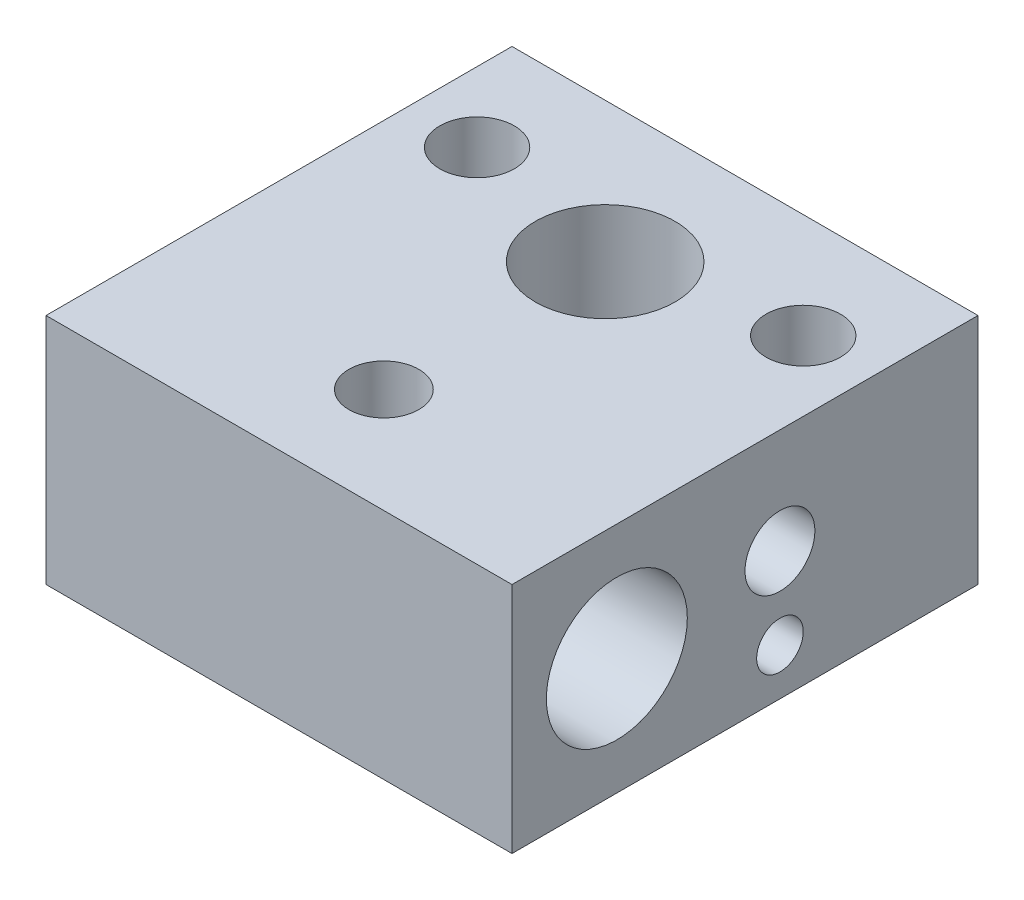
ISO-10303-21;
HEADER;
FILE_DESCRIPTION(('STEP AP214'),'2;1');
FILE_NAME('part.step','',(''),(''),'','','');
FILE_SCHEMA(('AUTOMOTIVE_DESIGN { 1 0 10303 214 1 1 1 1 }'));
ENDSEC;
DATA;
#1=APPLICATION_CONTEXT('core data for automotive mechanical design processes');
#2=APPLICATION_PROTOCOL_DEFINITION('international standard','automotive_design',2000,#1);
#3=PRODUCT_CONTEXT('',#1,'mechanical');
#4=PRODUCT('Part','Part','',(#3));
#5=PRODUCT_RELATED_PRODUCT_CATEGORY('part','',(#4));
#6=PRODUCT_DEFINITION_FORMATION('','',#4);
#7=PRODUCT_DEFINITION_CONTEXT('part definition',#1,'design');
#8=PRODUCT_DEFINITION('design','',#6,#7);
#9=PRODUCT_DEFINITION_SHAPE('','',#8);
#10=(LENGTH_UNIT() NAMED_UNIT(*) SI_UNIT(.MILLI.,.METRE.));
#11=(NAMED_UNIT(*) PLANE_ANGLE_UNIT() SI_UNIT($,.RADIAN.));
#12=(NAMED_UNIT(*) SI_UNIT($,.STERADIAN.) SOLID_ANGLE_UNIT());
#13=UNCERTAINTY_MEASURE_WITH_UNIT(LENGTH_MEASURE(1.E-05),#10,'distance_accuracy_value','');
#14=(GEOMETRIC_REPRESENTATION_CONTEXT(3) GLOBAL_UNCERTAINTY_ASSIGNED_CONTEXT((#13)) GLOBAL_UNIT_ASSIGNED_CONTEXT((#10,
#11,#12)) REPRESENTATION_CONTEXT('',''));
#15=CARTESIAN_POINT('',(0.,0.,0.));
#16=DIRECTION('',(0.,0.,1.));
#17=DIRECTION('',(1.,0.,0.));
#18=AXIS2_PLACEMENT_3D('',#15,#16,#17);
#19=CARTESIAN_POINT('',(10.,-10.,10.));
#20=DIRECTION('',(1.,0.,0.));
#21=DIRECTION('',(0.,0.,-1.));
#22=AXIS2_PLACEMENT_3D('',#19,#20,#21);
#23=PLANE('',#22);
#24=CARTESIAN_POINT('',(10.,-5.,5.5));
#25=DIRECTION('',(1.,0.,0.));
#26=DIRECTION('',(0.,0.,-1.));
#27=AXIS2_PLACEMENT_3D('',#24,#25,#26);
#28=CIRCLE('',#27,3.025);
#29=CARTESIAN_POINT('',(10.,-5.,2.475));
#30=VERTEX_POINT('',#29);
#31=EDGE_CURVE('E226',#30,#30,#28,.T.);
#32=ORIENTED_EDGE('',*,*,#31,.F.);
#33=EDGE_LOOP('',(#32));
#34=FACE_BOUND('',#33,.T.);
#35=CARTESIAN_POINT('',(10.,-4.5,-1.5));
#36=DIRECTION('',(1.,0.,0.));
#37=DIRECTION('',(0.,0.,-1.));
#38=AXIS2_PLACEMENT_3D('',#35,#36,#37);
#39=CIRCLE('',#38,1.5);
#40=CARTESIAN_POINT('',(10.,-4.5,-3.));
#41=VERTEX_POINT('',#40);
#42=EDGE_CURVE('E220',#41,#41,#39,.T.);
#43=ORIENTED_EDGE('',*,*,#42,.F.);
#44=EDGE_LOOP('',(#43));
#45=FACE_BOUND('',#44,.T.);
#46=CARTESIAN_POINT('',(10.,-8.,-1.5));
#47=DIRECTION('',(1.,0.,0.));
#48=DIRECTION('',(0.,0.,-1.));
#49=AXIS2_PLACEMENT_3D('',#46,#47,#48);
#50=CIRCLE('',#49,1.);
#51=CARTESIAN_POINT('',(10.,-8.,-2.5));
#52=VERTEX_POINT('',#51);
#53=EDGE_CURVE('E214',#52,#52,#50,.T.);
#54=ORIENTED_EDGE('',*,*,#53,.F.);
#55=EDGE_LOOP('',(#54));
#56=FACE_BOUND('',#55,.T.);
#57=DIRECTION('',(0.,0.,-1.));
#58=VECTOR('',#57,1.);
#59=CARTESIAN_POINT('',(10.,0.,10.));
#60=LINE('',#59,#58);
#61=CARTESIAN_POINT('',(10.,0.,10.));
#62=VERTEX_POINT('',#61);
#63=CARTESIAN_POINT('',(10.,0.,-10.));
#64=VERTEX_POINT('',#63);
#65=EDGE_CURVE('E116',#62,#64,#60,.T.);
#66=ORIENTED_EDGE('',*,*,#65,.F.);
#67=DIRECTION('',(0.,1.,0.));
#68=VECTOR('',#67,1.);
#69=CARTESIAN_POINT('',(10.,-10.,10.));
#70=LINE('',#69,#68);
#71=CARTESIAN_POINT('',(10.,-10.,10.));
#72=VERTEX_POINT('',#71);
#73=EDGE_CURVE('E64',#72,#62,#70,.T.);
#74=ORIENTED_EDGE('',*,*,#73,.F.);
#75=DIRECTION('',(0.,0.,-1.));
#76=VECTOR('',#75,1.);
#77=CARTESIAN_POINT('',(10.,-10.,10.));
#78=LINE('',#77,#76);
#79=CARTESIAN_POINT('',(10.,-10.,-10.));
#80=VERTEX_POINT('',#79);
#81=EDGE_CURVE('E109',#72,#80,#78,.T.);
#82=ORIENTED_EDGE('',*,*,#81,.T.);
#83=DIRECTION('',(0.,1.,0.));
#84=VECTOR('',#83,1.);
#85=CARTESIAN_POINT('',(10.,-10.,-10.));
#86=LINE('',#85,#84);
#87=EDGE_CURVE('E92',#80,#64,#86,.T.);
#88=ORIENTED_EDGE('',*,*,#87,.T.);
#89=EDGE_LOOP('',(#66,#74,#82,#88));
#90=FACE_BOUND('',#89,.T.);
#91=ADVANCED_FACE('F39',(#34,#45,#56,#90),#23,.T.);
#92=CARTESIAN_POINT('',(-10.,-10.,10.));
#93=DIRECTION('',(0.,0.,1.));
#94=DIRECTION('',(1.,0.,0.));
#95=AXIS2_PLACEMENT_3D('',#92,#93,#94);
#96=PLANE('',#95);
#97=DIRECTION('',(1.,0.,0.));
#98=VECTOR('',#97,1.);
#99=CARTESIAN_POINT('',(-10.,0.,10.));
#100=LINE('',#99,#98);
#101=CARTESIAN_POINT('',(-10.,0.,10.));
#102=VERTEX_POINT('',#101);
#103=EDGE_CURVE('E111',#102,#62,#100,.T.);
#104=ORIENTED_EDGE('',*,*,#103,.F.);
#105=DIRECTION('',(0.,1.,0.));
#106=VECTOR('',#105,1.);
#107=CARTESIAN_POINT('',(-10.,-10.,10.));
#108=LINE('',#107,#106);
#109=CARTESIAN_POINT('',(-10.,-10.,10.));
#110=VERTEX_POINT('',#109);
#111=EDGE_CURVE('E81',#110,#102,#108,.T.);
#112=ORIENTED_EDGE('',*,*,#111,.F.);
#113=DIRECTION('',(1.,0.,0.));
#114=VECTOR('',#113,1.);
#115=CARTESIAN_POINT('',(-10.,-10.,10.));
#116=LINE('',#115,#114);
#117=EDGE_CURVE('E106',#110,#72,#116,.T.);
#118=ORIENTED_EDGE('',*,*,#117,.T.);
#119=ORIENTED_EDGE('',*,*,#73,.T.);
#120=EDGE_LOOP('',(#104,#112,#118,#119));
#121=FACE_BOUND('',#120,.T.);
#122=ADVANCED_FACE('F174',(#121),#96,.T.);
#123=CARTESIAN_POINT('',(-10.,-10.,10.));
#124=DIRECTION('',(-1.,0.,0.));
#125=DIRECTION('',(0.,0.,1.));
#126=AXIS2_PLACEMENT_3D('',#123,#124,#125);
#127=PLANE('',#126);
#128=CARTESIAN_POINT('',(-10.,-5.,5.5));
#129=DIRECTION('',(1.,0.,0.));
#130=DIRECTION('',(0.,0.,-1.));
#131=AXIS2_PLACEMENT_3D('',#128,#129,#130);
#132=CIRCLE('',#131,3.025);
#133=CARTESIAN_POINT('',(-10.,-5.,2.475));
#134=VERTEX_POINT('',#133);
#135=EDGE_CURVE('E144',#134,#134,#132,.T.);
#136=ORIENTED_EDGE('',*,*,#135,.T.);
#137=EDGE_LOOP('',(#136));
#138=FACE_BOUND('',#137,.T.);
#139=CARTESIAN_POINT('',(-10.,-4.5,-1.5));
#140=DIRECTION('',(1.,0.,0.));
#141=DIRECTION('',(0.,0.,-1.));
#142=AXIS2_PLACEMENT_3D('',#139,#140,#141);
#143=CIRCLE('',#142,1.5);
#144=CARTESIAN_POINT('',(-10.,-4.5,-3.));
#145=VERTEX_POINT('',#144);
#146=EDGE_CURVE('E223',#145,#145,#143,.T.);
#147=ORIENTED_EDGE('',*,*,#146,.T.);
#148=EDGE_LOOP('',(#147));
#149=FACE_BOUND('',#148,.T.);
#150=CARTESIAN_POINT('',(-10.,-8.,-1.5));
#151=DIRECTION('',(1.,0.,0.));
#152=DIRECTION('',(0.,0.,-1.));
#153=AXIS2_PLACEMENT_3D('',#150,#151,#152);
#154=CIRCLE('',#153,1.);
#155=CARTESIAN_POINT('',(-10.,-8.,-2.5));
#156=VERTEX_POINT('',#155);
#157=EDGE_CURVE('E217',#156,#156,#154,.T.);
#158=ORIENTED_EDGE('',*,*,#157,.T.);
#159=EDGE_LOOP('',(#158));
#160=FACE_BOUND('',#159,.T.);
#161=DIRECTION('',(0.,0.,1.));
#162=VECTOR('',#161,1.);
#163=CARTESIAN_POINT('',(-10.,0.,10.));
#164=LINE('',#163,#162);
#165=CARTESIAN_POINT('',(-10.,0.,-10.));
#166=VERTEX_POINT('',#165);
#167=EDGE_CURVE('E100',#166,#102,#164,.T.);
#168=ORIENTED_EDGE('',*,*,#167,.F.);
#169=DIRECTION('',(0.,1.,0.));
#170=VECTOR('',#169,1.);
#171=CARTESIAN_POINT('',(-10.,-10.,-10.));
#172=LINE('',#171,#170);
#173=CARTESIAN_POINT('',(-10.,-10.,-10.));
#174=VERTEX_POINT('',#173);
#175=EDGE_CURVE('E95',#174,#166,#172,.T.);
#176=ORIENTED_EDGE('',*,*,#175,.F.);
#177=DIRECTION('',(0.,0.,1.));
#178=VECTOR('',#177,1.);
#179=CARTESIAN_POINT('',(-10.,-10.,10.));
#180=LINE('',#179,#178);
#181=EDGE_CURVE('E98',#174,#110,#180,.T.);
#182=ORIENTED_EDGE('',*,*,#181,.T.);
#183=ORIENTED_EDGE('',*,*,#111,.T.);
#184=EDGE_LOOP('',(#168,#176,#182,#183));
#185=FACE_BOUND('',#184,.T.);
#186=ADVANCED_FACE('F97',(#138,#149,#160,#185),#127,.T.);
#187=CARTESIAN_POINT('',(-10.,-10.,-10.));
#188=DIRECTION('',(0.,0.,-1.));
#189=DIRECTION('',(-1.,0.,0.));
#190=AXIS2_PLACEMENT_3D('',#187,#188,#189);
#191=PLANE('',#190);
#192=DIRECTION('',(-1.,0.,0.));
#193=VECTOR('',#192,1.);
#194=CARTESIAN_POINT('',(-10.,0.,-10.));
#195=LINE('',#194,#193);
#196=EDGE_CURVE('E119',#64,#166,#195,.T.);
#197=ORIENTED_EDGE('',*,*,#196,.F.);
#198=ORIENTED_EDGE('',*,*,#87,.F.);
#199=DIRECTION('',(-1.,0.,0.));
#200=VECTOR('',#199,1.);
#201=CARTESIAN_POINT('',(-10.,-10.,-10.));
#202=LINE('',#201,#200);
#203=EDGE_CURVE('E105',#80,#174,#202,.T.);
#204=ORIENTED_EDGE('',*,*,#203,.T.);
#205=ORIENTED_EDGE('',*,*,#175,.T.);
#206=EDGE_LOOP('',(#197,#198,#204,#205));
#207=FACE_BOUND('',#206,.T.);
#208=ADVANCED_FACE('F108',(#207),#191,.T.);
#209=CARTESIAN_POINT('',(0.,-10.,0.));
#210=DIRECTION('',(0.,-1.,0.));
#211=DIRECTION('',(0.,0.,-1.));
#212=AXIS2_PLACEMENT_3D('',#209,#210,#211);
#213=PLANE('',#212);
#214=CARTESIAN_POINT('',(-7.,-10.,-5.5));
#215=DIRECTION('',(0.,-1.,0.));
#216=DIRECTION('',(0.,0.,-1.));
#217=AXIS2_PLACEMENT_3D('',#214,#215,#216);
#218=CIRCLE('',#217,2.60000000000001);
#219=CARTESIAN_POINT('',(-7.,-10.,-8.10000000000001));
#220=VERTEX_POINT('',#219);
#221=EDGE_CURVE('E11',#220,#220,#218,.F.);
#222=ORIENTED_EDGE('',*,*,#221,.T.);
#223=EDGE_LOOP('',(#222));
#224=FACE_BOUND('',#223,.T.);
#225=CARTESIAN_POINT('',(7.,-10.,-5.5));
#226=DIRECTION('',(0.,-1.,0.));
#227=DIRECTION('',(0.,0.,-1.));
#228=AXIS2_PLACEMENT_3D('',#225,#226,#227);
#229=CIRCLE('',#228,2.6);
#230=CARTESIAN_POINT('',(7.,-10.,-8.1));
#231=VERTEX_POINT('',#230);
#232=EDGE_CURVE('E126',#231,#231,#229,.F.);
#233=ORIENTED_EDGE('',*,*,#232,.T.);
#234=EDGE_LOOP('',(#233));
#235=FACE_BOUND('',#234,.T.);
#236=CARTESIAN_POINT('',(0.,-10.,-4.));
#237=DIRECTION('',(0.,1.,0.));
#238=DIRECTION('',(0.,0.,1.));
#239=AXIS2_PLACEMENT_3D('',#236,#237,#238);
#240=CIRCLE('',#239,3.);
#241=CARTESIAN_POINT('',(0.,-10.,-1.));
#242=VERTEX_POINT('',#241);
#243=EDGE_CURVE('E120',#242,#242,#240,.T.);
#244=ORIENTED_EDGE('',*,*,#243,.T.);
#245=EDGE_LOOP('',(#244));
#246=FACE_BOUND('',#245,.T.);
#247=ORIENTED_EDGE('',*,*,#81,.F.);
#248=ORIENTED_EDGE('',*,*,#117,.F.);
#249=ORIENTED_EDGE('',*,*,#181,.F.);
#250=ORIENTED_EDGE('',*,*,#203,.F.);
#251=EDGE_LOOP('',(#247,#248,#249,#250));
#252=FACE_BOUND('',#251,.T.);
#253=ADVANCED_FACE('F104',(#224,#235,#246,#252),#213,.T.);
#254=CARTESIAN_POINT('',(0.,0.,0.));
#255=DIRECTION('',(0.,-1.,0.));
#256=DIRECTION('',(0.,0.,-1.));
#257=AXIS2_PLACEMENT_3D('',#254,#255,#256);
#258=PLANE('',#257);
#259=CARTESIAN_POINT('',(0.,0.,5.5));
#260=DIRECTION('',(0.,1.,0.));
#261=DIRECTION('',(0.,0.,1.));
#262=AXIS2_PLACEMENT_3D('',#259,#260,#261);
#263=CIRCLE('',#262,1.5);
#264=CARTESIAN_POINT('',(0.,0.,7.));
#265=VERTEX_POINT('',#264);
#266=EDGE_CURVE('E231',#265,#265,#263,.T.);
#267=ORIENTED_EDGE('',*,*,#266,.F.);
#268=EDGE_LOOP('',(#267));
#269=FACE_BOUND('',#268,.T.);
#270=CARTESIAN_POINT('',(-7.,0.,-5.5));
#271=DIRECTION('',(0.,-1.,0.));
#272=DIRECTION('',(0.,0.,1.));
#273=AXIS2_PLACEMENT_3D('',#270,#271,#272);
#274=CIRCLE('',#273,1.6);
#275=CARTESIAN_POINT('',(-7.,0.,-3.9));
#276=VERTEX_POINT('',#275);
#277=EDGE_CURVE('E211',#276,#276,#274,.T.);
#278=ORIENTED_EDGE('',*,*,#277,.T.);
#279=EDGE_LOOP('',(#278));
#280=FACE_BOUND('',#279,.T.);
#281=CARTESIAN_POINT('',(7.,0.,-5.5));
#282=DIRECTION('',(0.,1.,0.));
#283=DIRECTION('',(0.,0.,1.));
#284=AXIS2_PLACEMENT_3D('',#281,#282,#283);
#285=CIRCLE('',#284,1.6);
#286=CARTESIAN_POINT('',(7.,0.,-3.9));
#287=VERTEX_POINT('',#286);
#288=EDGE_CURVE('E207',#287,#287,#285,.T.);
#289=ORIENTED_EDGE('',*,*,#288,.F.);
#290=EDGE_LOOP('',(#289));
#291=FACE_BOUND('',#290,.T.);
#292=CARTESIAN_POINT('',(0.,0.,-4.));
#293=DIRECTION('',(0.,1.,0.));
#294=DIRECTION('',(0.,0.,1.));
#295=AXIS2_PLACEMENT_3D('',#292,#293,#294);
#296=CIRCLE('',#295,3.);
#297=CARTESIAN_POINT('',(0.,0.,-1.));
#298=VERTEX_POINT('',#297);
#299=EDGE_CURVE('E204',#298,#298,#296,.T.);
#300=ORIENTED_EDGE('',*,*,#299,.F.);
#301=EDGE_LOOP('',(#300));
#302=FACE_BOUND('',#301,.T.);
#303=ORIENTED_EDGE('',*,*,#65,.T.);
#304=ORIENTED_EDGE('',*,*,#196,.T.);
#305=ORIENTED_EDGE('',*,*,#167,.T.);
#306=ORIENTED_EDGE('',*,*,#103,.T.);
#307=EDGE_LOOP('',(#303,#304,#305,#306));
#308=FACE_BOUND('',#307,.T.);
#309=ADVANCED_FACE('F170',(#269,#280,#291,#302,#308),#258,.F.);
#310=CARTESIAN_POINT('',(0.,-10.,-4.));
#311=DIRECTION('',(0.,1.,0.));
#312=DIRECTION('',(0.,0.,1.));
#313=AXIS2_PLACEMENT_3D('',#310,#311,#312);
#314=CYLINDRICAL_SURFACE('',#313,3.);
#315=CARTESIAN_POINT('',(0.,-5.9142135623731,-1.));
#316=CARTESIAN_POINT('',(0.0812781165599234,-5.91421419676171,-1.00000020593779));
#317=CARTESIAN_POINT('',(0.162559675062226,-5.91539565861383,-1.00330607435305));
#318=CARTESIAN_POINT('',(0.324527269001277,-5.91995537048998,-1.01649774916631));
#319=CARTESIAN_POINT('',(0.405213249683678,-5.9233338200112,-1.02638415311097));
#320=CARTESIAN_POINT('',(0.565571380594202,-5.93181280392301,-1.05267189975348));
#321=CARTESIAN_POINT('',(0.645241428723378,-5.93691644779367,-1.06908501564682));
#322=CARTESIAN_POINT('',(0.802961144028822,-5.94810067414035,-1.10831167387967));
#323=CARTESIAN_POINT('',(0.881009919464724,-5.9541817789756,-1.13112864335699));
#324=CARTESIAN_POINT('',(1.03581994412866,-5.96643234772676,-1.18329627365664));
#325=CARTESIAN_POINT('',(1.11255856057412,-5.97260206197915,-1.21271406993221));
#326=CARTESIAN_POINT('',(1.26343152880077,-5.98381507282182,-1.27777859317932));
#327=CARTESIAN_POINT('',(1.33756608535768,-5.9888584581512,-1.3134248290415));
#328=CARTESIAN_POINT('',(1.48262611866191,-5.99651345958119,-1.39067902661541));
#329=CARTESIAN_POINT('',(1.55355755907156,-5.99912978842127,-1.43227525279195));
#330=CARTESIAN_POINT('',(1.69175959456744,-6.00050865603534,-1.52115001061164));
#331=CARTESIAN_POINT('',(1.75903237295958,-5.99927351942474,-1.56842509812239));
#332=CARTESIAN_POINT('',(1.90716391011818,-5.99029690278605,-1.68189067094935));
#333=CARTESIAN_POINT('',(1.98669971740415,-5.98086668197518,-1.74971626944584));
#334=CARTESIAN_POINT('',(2.13698583196572,-5.94971103785101,-1.89193339788951));
#335=CARTESIAN_POINT('',(2.20775007255812,-5.92800542678185,-1.96631418499126));
#336=CARTESIAN_POINT('',(2.32759948974123,-5.87404222562634,-2.10546939365853));
#337=CARTESIAN_POINT('',(2.37832782782023,-5.84418385525943,-2.16974637102466));
#338=CARTESIAN_POINT('',(2.47149325228116,-5.77244105598872,-2.29765748743824));
#339=CARTESIAN_POINT('',(2.51393370698217,-5.73056152982501,-2.36129187762969));
#340=CARTESIAN_POINT('',(2.59023012292156,-5.63421427562723,-2.48474048596269));
#341=CARTESIAN_POINT('',(2.62404074205314,-5.57968282056205,-2.54453333933052));
#342=CARTESIAN_POINT('',(2.68297902260017,-5.45906570182386,-2.65626298553931));
#343=CARTESIAN_POINT('',(2.70810740051637,-5.39298099225977,-2.7082004264481));
#344=CARTESIAN_POINT('',(2.74854995681768,-5.25775126404401,-2.79682265229361));
#345=CARTESIAN_POINT('',(2.76455038851263,-5.18943558532157,-2.83446671614892));
#346=CARTESIAN_POINT('',(2.79086008447636,-5.04686970893329,-2.8989467578759));
#347=CARTESIAN_POINT('',(2.80116982361409,-4.97262000703362,-2.92578363751979));
#348=CARTESIAN_POINT('',(2.81673968492676,-4.82114470899416,-2.96730090752356));
#349=CARTESIAN_POINT('',(2.82205144842423,-4.74395831796083,-2.98210539936281));
#350=CARTESIAN_POINT('',(2.82825388110362,-4.58804408826337,-2.99946707205539));
#351=CARTESIAN_POINT('',(2.82914433742514,-4.50931617556706,-3.00202366324285));
#352=CARTESIAN_POINT('',(2.82656880466972,-4.35162251575824,-2.99475172078534));
#353=CARTESIAN_POINT('',(2.82305415635021,-4.27266389548815,-2.9847848485857));
#354=CARTESIAN_POINT('',(2.81127389330315,-4.1176459584725,-2.95260820068876));
#355=CARTESIAN_POINT('',(2.80300833946765,-4.04158660458055,-2.93039858190606));
#356=CARTESIAN_POINT('',(2.78110778103489,-3.89469718070092,-2.87468748466118));
#357=CARTESIAN_POINT('',(2.76748235163573,-3.82385805148488,-2.84120615793812));
#358=CARTESIAN_POINT('',(2.73406768149438,-3.68932437049373,-2.7644364674315));
#359=CARTESIAN_POINT('',(2.71427997852502,-3.62562804164654,-2.72115055108138));
#360=CARTESIAN_POINT('',(2.668089342982,-3.50776073658234,-2.62741566971029));
#361=CARTESIAN_POINT('',(2.64176551762725,-3.45348816966213,-2.57705528343792));
#362=CARTESIAN_POINT('',(2.5820096551102,-3.35465934356592,-2.47130568965431));
#363=CARTESIAN_POINT('',(2.54857782235952,-3.31010280505159,-2.41591662678367));
#364=CARTESIAN_POINT('',(2.47392552254732,-3.23021922701359,-2.30163583017241));
#365=CARTESIAN_POINT('',(2.43256121663182,-3.19509706119695,-2.24269591399422));
#366=CARTESIAN_POINT('',(2.34299549262076,-3.13477785237813,-2.12494147767165));
#367=CARTESIAN_POINT('',(2.29479098631331,-3.10958531191486,-2.06612702641322));
#368=CARTESIAN_POINT('',(2.20749942179887,-3.07414795735893,-1.96778067137115));
#369=CARTESIAN_POINT('',(2.16991597811958,-3.06168595258135,-1.92767735915761));
#370=CARTESIAN_POINT('',(2.09205052758593,-3.04062137457977,-1.84909620765718));
#371=CARTESIAN_POINT('',(2.05176760916952,-3.03202011268094,-1.81061892467477));
#372=CARTESIAN_POINT('',(1.92718610336878,-3.01119066356135,-1.69816335645664));
#373=CARTESIAN_POINT('',(1.8392424588998,-3.00396934792599,-1.6272607686684));
#374=CARTESIAN_POINT('',(1.6210567380733,-2.99752967339115,-1.4708845510208));
#375=CARTESIAN_POINT('',(1.48741388836536,-3.00238061616288,-1.39006982958794));
#376=CARTESIAN_POINT('',(1.20951572460835,-3.01926356126468,-1.25021275396288));
#377=CARTESIAN_POINT('',(1.06524630194782,-3.03130526690874,-1.19119999412854));
#378=CARTESIAN_POINT('',(0.841443586457378,-3.048898928112,-1.11931595595895));
#379=CARTESIAN_POINT('',(0.764563903852258,-3.05475796984063,-1.09796437699782));
#380=CARTESIAN_POINT('',(0.609257678882911,-3.065417245292,-1.061435118021));
#381=CARTESIAN_POINT('',(0.530831131286684,-3.07021747543283,-1.04625745889128));
#382=CARTESIAN_POINT('',(0.373051036425848,-3.07807077798007,-1.02221684882496));
#383=CARTESIAN_POINT('',(0.293699064738095,-3.08112647316326,-1.0133444135176));
#384=CARTESIAN_POINT('',(0.134485229448482,-3.08508420103209,-1.0019535713228));
#385=CARTESIAN_POINT('',(0.0546233762848958,-3.08598627766568,-0.999435034774052));
#386=CARTESIAN_POINT('',(-0.107191424063922,-3.08550532102755,-1.0007948684242));
#387=CARTESIAN_POINT('',(-0.18914276520132,-3.08406009405382,-1.00484733798075));
#388=CARTESIAN_POINT('',(-0.352371987000994,-3.07897438210538,-1.01963914657314));
#389=CARTESIAN_POINT('',(-0.433649824844768,-3.07533375862576,-1.03037890750349));
#390=CARTESIAN_POINT('',(-0.595109713815738,-3.06637795719456,-1.05847451700335));
#391=CARTESIAN_POINT('',(-0.675289476672139,-3.06105971414146,-1.0758424879553));
#392=CARTESIAN_POINT('',(-0.83393950713784,-3.04954329698528,-1.11707322840658));
#393=CARTESIAN_POINT('',(-0.912408822668777,-3.0433446465594,-1.14093952011491));
#394=CARTESIAN_POINT('',(-1.06751505866676,-3.0310407882592,-1.19514826477512));
#395=CARTESIAN_POINT('',(-1.14414127696391,-3.02493617756902,-1.22552149166801));
#396=CARTESIAN_POINT('',(-1.29471018071052,-3.0140328914382,-1.29250773428653));
#397=CARTESIAN_POINT('',(-1.36865312773998,-3.00923408840228,-1.32912013979004));
#398=CARTESIAN_POINT('',(-1.51322345550144,-3.00227970642834,-1.40829614057436));
#399=CARTESIAN_POINT('',(-1.58385767964018,-3.00011841707767,-1.4508466558617));
#400=CARTESIAN_POINT('',(-1.72135417277446,-2.99989108709187,-1.54160158593916));
#401=CARTESIAN_POINT('',(-1.78821884241198,-3.00182240912636,-1.58980234073407));
#402=CARTESIAN_POINT('',(-1.93389486754565,-3.01259187458266,-1.70421294251046));
#403=CARTESIAN_POINT('',(-2.01145844827881,-3.02305120235904,-1.77189661655493));
#404=CARTESIAN_POINT('',(-2.15785992277711,-3.05626608005046,-1.91338619215153));
#405=CARTESIAN_POINT('',(-2.22671122659282,-3.07900244167828,-1.98718238821433));
#406=CARTESIAN_POINT('',(-2.34356359023376,-3.13485830119163,-2.12529412167465));
#407=CARTESIAN_POINT('',(-2.39313424778864,-3.16568484570633,-2.1891972458077));
#408=CARTESIAN_POINT('',(-2.48402700786907,-3.23927540709552,-2.31604981685747));
#409=CARTESIAN_POINT('',(-2.52535227745661,-3.28203482534461,-2.37899962132643));
#410=CARTESIAN_POINT('',(-2.59951118844858,-3.37992575094793,-2.50078008405557));
#411=CARTESIAN_POINT('',(-2.63230279115095,-3.43511609875093,-2.55958934635161));
#412=CARTESIAN_POINT('',(-2.68937766504872,-3.55675406985943,-2.66918039968469));
#413=CARTESIAN_POINT('',(-2.7136613613826,-3.62320113042286,-2.7199625917633));
#414=CARTESIAN_POINT('',(-2.75277285300849,-3.75915919877612,-2.80655537534392));
#415=CARTESIAN_POINT('',(-2.76823663820603,-3.82790869078287,-2.84328075223141));
#416=CARTESIAN_POINT('',(-2.79356136592927,-3.97114642335826,-2.90585208952594));
#417=CARTESIAN_POINT('',(-2.80342274411546,-4.04563421718711,-2.93169889584374));
#418=CARTESIAN_POINT('',(-2.8181868581865,-4.19757989931041,-2.97127810619454));
#419=CARTESIAN_POINT('',(-2.8231286246306,-4.27500926608942,-2.98510575309039));
#420=CARTESIAN_POINT('',(-2.82860780171354,-4.43123327953568,-3.00047736550803));
#421=CARTESIAN_POINT('',(-2.82914498284812,-4.5100279971312,-3.00202069094575));
#422=CARTESIAN_POINT('',(-2.82584450369889,-4.66765780573111,-2.99271276524069));
#423=CARTESIAN_POINT('',(-2.82195900466564,-4.74648394108108,-2.98172597725039));
#424=CARTESIAN_POINT('',(-2.80939332940375,-4.90105288060382,-2.94755653980089));
#425=CARTESIAN_POINT('',(-2.80071326062384,-4.9767957538332,-2.92437416365153));
#426=CARTESIAN_POINT('',(-2.77792702682189,-5.12282744829372,-2.86683146452648));
#427=CARTESIAN_POINT('',(-2.76383406565538,-5.19312904509511,-2.83249837310031));
#428=CARTESIAN_POINT('',(-2.7294244251365,-5.32643804851472,-2.75418209604566));
#429=CARTESIAN_POINT('',(-2.70910932349743,-5.38944729863827,-2.71020135751839));
#430=CARTESIAN_POINT('',(-2.6618252272003,-5.5058490369479,-2.61527762948143));
#431=CARTESIAN_POINT('',(-2.6349347760192,-5.5593430237908,-2.56441978014811));
#432=CARTESIAN_POINT('',(-2.57403675678893,-5.65656473827319,-2.45789394180357));
#433=CARTESIAN_POINT('',(-2.54002922673543,-5.70029251804857,-2.40222597847283));
#434=CARTESIAN_POINT('',(-2.46413765143573,-5.77862540377295,-2.2874392734462));
#435=CARTESIAN_POINT('',(-2.42209031222697,-5.81299733729222,-2.22827059472184));
#436=CARTESIAN_POINT('',(-2.33118350079586,-5.87183911464566,-2.11025592310223));
#437=CARTESIAN_POINT('',(-2.28232098774542,-5.89630451921099,-2.05141008650318));
#438=CARTESIAN_POINT('',(-2.19363690914737,-5.93068311151267,-1.95280545508218));
#439=CARTESIAN_POINT('',(-2.15528387993643,-5.94275852179382,-1.91244562032932));
#440=CARTESIAN_POINT('',(-2.07586353401801,-5.96303526486245,-1.83345147018154));
#441=CARTESIAN_POINT('',(-2.03479527290357,-5.97123524153719,-1.79481776307813));
#442=CARTESIAN_POINT('',(-1.90781016894857,-5.99087529689436,-1.68201545227566));
#443=CARTESIAN_POINT('',(-1.81821060506144,-5.99732109844442,-1.61105484220797));
#444=CARTESIAN_POINT('',(-1.66061439338699,-6.00068139204464,-1.50028498927078));
#445=CARTESIAN_POINT('',(-1.59456558013536,-5.99993670642901,-1.45765112163246));
#446=CARTESIAN_POINT('',(-1.45939749545025,-5.99554321246458,-1.37772793047961));
#447=CARTESIAN_POINT('',(-1.39027852250591,-5.99189468585401,-1.3404380888879));
#448=CARTESIAN_POINT('',(-1.24935806569325,-5.98288735489139,-1.27139722329787));
#449=CARTESIAN_POINT('',(-1.17755372457229,-5.97752668029115,-1.2396523151864));
#450=CARTESIAN_POINT('',(-1.03175379743015,-5.96618025869435,-1.18191060300552));
#451=CARTESIAN_POINT('',(-0.957759164831322,-5.9601947808861,-1.15591133842706));
#452=CARTESIAN_POINT('',(-0.811525640003674,-5.94882755964797,-1.11088316188309));
#453=CARTESIAN_POINT('',(-0.739372183274603,-5.94343063185091,-1.09158022356606));
#454=CARTESIAN_POINT('',(-0.593784979550729,-5.93362899664656,-1.05840336786971));
#455=CARTESIAN_POINT('',(-0.520351702362276,-5.92922393307263,-1.04452750037054));
#456=CARTESIAN_POINT('',(-0.372665673490753,-5.92194978852974,-1.02230134282693));
#457=CARTESIAN_POINT('',(-0.298414016174756,-5.91907886267956,-1.01394441310316));
#458=CARTESIAN_POINT('',(-0.149442552104532,-5.91521042835181,-1.00279355901727));
#459=CARTESIAN_POINT('',(-0.0747227306128194,-5.91421297915031,-0.999999810671865));
#460=CARTESIAN_POINT('',(0.,-5.9142135623731,-1.));
#461=B_SPLINE_CURVE_WITH_KNOTS('',3,(#315,#316,#317,#318,#319,#320,#321,#322,#323,#324,#325,
#326,#327,#328,#329,#330,#331,#332,#333,#334,#335,#336,#337,#338,#339,#340,#341,#342,#343,#344,
#345,#346,#347,#348,#349,#350,#351,#352,#353,#354,#355,#356,#357,#358,#359,#360,#361,#362,#363,
#364,#365,#366,#367,#368,#369,#370,#371,#372,#373,#374,#375,#376,#377,#378,#379,#380,#381,#382,
#383,#384,#385,#386,#387,#388,#389,#390,#391,#392,#393,#394,#395,#396,#397,#398,#399,#400,#401,
#402,#403,#404,#405,#406,#407,#408,#409,#410,#411,#412,#413,#414,#415,#416,#417,#418,#419,#420,
#421,#422,#423,#424,#425,#426,#427,#428,#429,#430,#431,#432,#433,#434,#435,#436,#437,#438,#439,
#440,#441,#442,#443,#444,#445,#446,#447,#448,#449,#450,#451,#452,#453,#454,#455,#456,#457,#458,
#459,#460),.UNSPECIFIED.,.T.,.F.,(4,2,2,2,2,2,2,2,2,2,2,2,2,2,2,2,2,2,2,2,2,2,2,2,2,2,2,2,2,2,2,
2,2,2,2,2,2,2,2,2,2,2,2,2,2,2,2,2,2,2,2,2,2,2,2,2,2,2,2,2,2,2,2,2,2,2,2,2,2,2,2,2,4),(0.,
0.243765579982384,0.487553298159904,0.731782781767619,0.976143219238403,1.22311173640348,
1.47006078900388,1.71652931812014,1.96284911589706,2.27660695419291,2.5898598326761,
2.85024301653766,3.11052015555189,3.37213790469935,3.63373405871841,3.87146253500188,
4.10917117065231,4.34439581623575,4.57963178641758,4.81748924938684,5.05534366382082,
5.29277507684794,5.53014728714886,5.76477578136255,5.9993975290567,6.23876410197418,
6.47823908994014,6.64709046885431,6.81599915586443,7.15422072026853,7.62060075209292,
8.08761155019292,8.32741093973742,8.56721114050036,8.80664986387238,9.04608370108121,
9.29196564376276,9.53786310046123,9.78421245293193,10.0306955979915,10.278371263757,
10.5260227195212,10.7731370347789,11.0200921548839,11.329417840492,11.6382614615863,
11.8968257249656,12.1552904815425,12.4150053689802,12.6747072766619,12.9119572651004,
13.1491888017203,13.3845228542313,13.6198691689247,13.8577855417873,14.0956965830403,
14.3330309280989,14.5703051433686,14.8048728008217,15.0394392060301,15.2794052505953,
15.5194787089687,15.6901668844842,15.8609147439897,16.2028561070797,16.4384518825074,
16.6740248026042,16.9098559336573,17.1455858760568,17.3700349058025,17.5944032095835,
17.8185010880098,18.0426060566858),.UNSPECIFIED.);
#462=CARTESIAN_POINT('',(0.,-5.9142135623731,-1.));
#463=VERTEX_POINT('',#462);
#464=EDGE_CURVE('E143',#463,#463,#461,.T.);
#465=ORIENTED_EDGE('',*,*,#464,.T.);
#466=EDGE_LOOP('',(#465));
#467=FACE_BOUND('',#466,.T.);
#468=CARTESIAN_POINT('',(0.,-8.86602540378444,-1.));
#469=CARTESIAN_POINT('',(0.0749913837837183,-8.86602777945798,-1.00000052429499));
#470=CARTESIAN_POINT('',(0.149993474050667,-8.86766997029936,-1.00281565219104));
#471=CARTESIAN_POINT('',(0.299473376806713,-8.87400543725801,-1.0140430696739));
#472=CARTESIAN_POINT('',(0.373950905038836,-8.87870025563116,-1.0224581885522));
#473=CARTESIAN_POINT('',(0.522134515181121,-8.89049580935293,-1.04483324009074));
#474=CARTESIAN_POINT('',(0.595837004721195,-8.89760487107658,-1.05881239138935));
#475=CARTESIAN_POINT('',(0.741880069605806,-8.91326254507202,-1.09221222545507));
#476=CARTESIAN_POINT('',(0.81421981465946,-8.92181200529606,-1.11163611799938));
#477=CARTESIAN_POINT('',(0.960570173674766,-8.93961320108198,-1.15686034019202));
#478=CARTESIAN_POINT('',(1.03449987579648,-8.94887906482536,-1.1829171389148));
#479=CARTESIAN_POINT('',(1.18020519256363,-8.96629259019881,-1.24078646828336));
#480=CARTESIAN_POINT('',(1.25198103437941,-8.97444037008075,-1.27259838942391));
#481=CARTESIAN_POINT('',(1.39279462576575,-8.98802712767055,-1.34175756415358));
#482=CARTESIAN_POINT('',(1.46184093635388,-8.99347531701337,-1.37908542193254));
#483=CARTESIAN_POINT('',(1.59690658025406,-8.99997003913336,-1.45912577544854));
#484=CARTESIAN_POINT('',(1.66292873885919,-9.0010207667344,-1.50183309952036));
#485=CARTESIAN_POINT('',(1.79380793648619,-8.99668334436533,-1.59398701192777));
#486=CARTESIAN_POINT('',(1.85852087469242,-8.99104430116356,-1.64363051853718));
#487=CARTESIAN_POINT('',(1.98284310025361,-8.97038563163876,-1.74725645880184));
#488=CARTESIAN_POINT('',(2.04245669555334,-8.95537401409578,-1.80123515379931));
#489=CARTESIAN_POINT('',(2.14549206439041,-8.91689990643984,-1.90210795563989));
#490=CARTESIAN_POINT('',(2.18994419828518,-8.89530595637497,-1.94864807341322));
#491=CARTESIAN_POINT('',(2.27321363521337,-8.84248867952004,-2.04133669008066));
#492=CARTESIAN_POINT('',(2.31203832719423,-8.81127815103605,-2.08748562620354));
#493=CARTESIAN_POINT('',(2.37665961322169,-8.74503969183014,-2.16869144240497));
#494=CARTESIAN_POINT('',(2.4035440682546,-8.7116982748225,-2.20425398838591));
#495=CARTESIAN_POINT('',(2.45236214540353,-8.63815119697595,-2.27151916738771));
#496=CARTESIAN_POINT('',(2.47429710084777,-8.59794738991028,-2.30322283887466));
#497=CARTESIAN_POINT('',(2.51299800439154,-8.51115230747524,-2.36107819016065));
#498=CARTESIAN_POINT('',(2.52973834735284,-8.46453097686237,-2.38720217583276));
#499=CARTESIAN_POINT('',(2.55777714522959,-8.36633503597212,-2.43204538017936));
#500=CARTESIAN_POINT('',(2.56907678550612,-8.31476150756524,-2.45076621161354));
#501=CARTESIAN_POINT('',(2.5854760532499,-8.21315643838311,-2.47830767825872));
#502=CARTESIAN_POINT('',(2.59103840940311,-8.16339696314601,-2.48786182059216));
#503=CARTESIAN_POINT('',(2.59768958305742,-8.06271622048783,-2.49931528009361));
#504=CARTESIAN_POINT('',(2.59877970819899,-8.0117952970433,-2.50121683480693));
#505=CARTESIAN_POINT('',(2.59654001052358,-7.91225240195144,-2.49734131877626));
#506=CARTESIAN_POINT('',(2.59337306088286,-7.86361536186705,-2.49184719139491));
#507=CARTESIAN_POINT('',(2.58288283594349,-7.76809973994576,-2.47395194226654));
#508=CARTESIAN_POINT('',(2.57556001747799,-7.72122096543556,-2.46155157968902));
#509=CARTESIAN_POINT('',(2.55670934222057,-7.63037666828419,-2.43042473836453));
#510=CARTESIAN_POINT('',(2.54517067471629,-7.58641898179441,-2.41168200506578));
#511=CARTESIAN_POINT('',(2.51791176999083,-7.50263175936191,-2.36881552316815));
#512=CARTESIAN_POINT('',(2.50219126025382,-7.46280249268882,-2.34469142390125));
#513=CARTESIAN_POINT('',(2.46596103779757,-7.38655501338263,-2.29116469527239));
#514=CARTESIAN_POINT('',(2.44528393219976,-7.35033880128395,-2.26158859704398));
#515=CARTESIAN_POINT('',(2.39977919838168,-7.28370852957729,-2.19929240735142));
#516=CARTESIAN_POINT('',(2.37495033751033,-7.25329619889376,-2.16657138339311));
#517=CARTESIAN_POINT('',(2.31874582794914,-7.19550268027949,-2.09588467380922));
#518=CARTESIAN_POINT('',(2.28695867728335,-7.16876022207171,-2.05772655416399));
#519=CARTESIAN_POINT('',(2.21938498613416,-7.122042185695,-1.98085112527679));
#520=CARTESIAN_POINT('',(2.18359611703041,-7.10207057505517,-1.94213350198631));
#521=CARTESIAN_POINT('',(2.08676510452523,-7.05832694866157,-1.84301659143285));
#522=CARTESIAN_POINT('',(2.02314990572118,-7.03911009602297,-1.78311573167193));
#523=CARTESIAN_POINT('',(1.88944548800663,-7.0124494376129,-1.66808249473816));
#524=CARTESIAN_POINT('',(1.81933987669885,-7.00503635231122,-1.6129629122675));
#525=CARTESIAN_POINT('',(1.6909541470503,-6.99941928860163,-1.52100694725606));
#526=CARTESIAN_POINT('',(1.63364857622722,-6.99949340627014,-1.4828763609397));
#527=CARTESIAN_POINT('',(1.51663520453788,-7.0033408797204,-1.41068533952634));
#528=CARTESIAN_POINT('',(1.45692604097916,-7.00711636310452,-1.37662725800156));
#529=CARTESIAN_POINT('',(1.2745322424279,-7.0221836929593,-1.28072786380646));
#530=CARTESIAN_POINT('',(1.14873275431711,-7.03721629951021,-1.22526956640827));
#531=CARTESIAN_POINT('',(0.951386684718631,-7.06143478865702,-1.1539151929132));
#532=CARTESIAN_POINT('',(0.881953778488545,-7.07007079284541,-1.13164117194086));
#533=CARTESIAN_POINT('',(0.741582232919957,-7.08668170752553,-1.09218961073774));
#534=CARTESIAN_POINT('',(0.670644264662284,-7.09465690518919,-1.07500984819512));
#535=CARTESIAN_POINT('',(0.527717911264399,-7.10891148098488,-1.04588068503596));
#536=CARTESIAN_POINT('',(0.455732570117836,-7.1151950188436,-1.03391840901465));
#537=CARTESIAN_POINT('',(0.310905990633708,-7.12527655950142,-1.01526103266634));
#538=CARTESIAN_POINT('',(0.238064793684707,-7.1290746819939,-1.00856567869019));
#539=CARTESIAN_POINT('',(0.0837262039456343,-7.13392047803321,-1.0000640055171));
#540=CARTESIAN_POINT('',(0.00218077250386519,-7.13460885159002,-0.998895642057797));
#541=CARTESIAN_POINT('',(-0.160678991576793,-7.13213314867495,-1.00319819701262));
#542=CARTESIAN_POINT('',(-0.241993292154974,-7.12896856161199,-1.00866999537506));
#543=CARTESIAN_POINT('',(-0.403966637229233,-7.11930926766317,-1.02620336487791));
#544=CARTESIAN_POINT('',(-0.48462277679681,-7.11280400601486,-1.03828583018798));
#545=CARTESIAN_POINT('',(-0.644443684573013,-7.09753389706992,-1.06890423512525));
#546=CARTESIAN_POINT('',(-0.723608414613905,-7.08876899202919,-1.08744033967634));
#547=CARTESIAN_POINT('',(-0.94946481739151,-7.06214914151611,-1.15009720737935));
#548=CARTESIAN_POINT('',(-1.09389383447213,-7.04311619100715,-1.20234044145669));
#549=CARTESIAN_POINT('',(-1.30346572677013,-7.02031536294013,-1.29688231026185));
#550=CARTESIAN_POINT('',(-1.37207925648825,-7.01367696616523,-1.3310501663667));
#551=CARTESIAN_POINT('',(-1.50666660547381,-7.00386316621154,-1.40465289330757));
#552=CARTESIAN_POINT('',(-1.5726422167696,-7.00068537225588,-1.44408410675554));
#553=CARTESIAN_POINT('',(-1.71004433975918,-6.9994315678917,-1.53355853920933));
#554=CARTESIAN_POINT('',(-1.78102170358247,-7.00209377448792,-1.58431571469738));
#555=CARTESIAN_POINT('',(-1.91769543352472,-7.01699290202487,-1.69133336678109));
#556=CARTESIAN_POINT('',(-1.98339680084965,-7.02922063463149,-1.74758851684717));
#557=CARTESIAN_POINT('',(-2.09593492090022,-7.06288973828644,-1.85248968623637));
#558=CARTESIAN_POINT('',(-2.14397686501262,-7.08212278190803,-1.90053436222413));
#559=CARTESIAN_POINT('',(-2.23434729138702,-7.13057652435582,-1.99699349957484));
#560=CARTESIAN_POINT('',(-2.27668395918613,-7.15978269699474,-2.04540732355005));
#561=CARTESIAN_POINT('',(-2.34695258438092,-7.22253752283442,-2.13070493251596));
#562=CARTESIAN_POINT('',(-2.37608749550014,-7.25415891427367,-2.16801006969669));
#563=CARTESIAN_POINT('',(-2.42933040768753,-7.32468344259989,-2.23922514807033));
#564=CARTESIAN_POINT('',(-2.45343986935047,-7.36358445748446,-2.27313607426185));
#565=CARTESIAN_POINT('',(-2.49635379906896,-7.44837806176497,-2.33576635106523));
#566=CARTESIAN_POINT('',(-2.5151278600428,-7.49430851705947,-2.36445562232417));
#567=CARTESIAN_POINT('',(-2.54699441742181,-7.59179785984245,-2.41453241811598));
#568=CARTESIAN_POINT('',(-2.5600885989952,-7.64335507223394,-2.43592210796561));
#569=CARTESIAN_POINT('',(-2.57954823886616,-7.74496605185746,-2.468252171939));
#570=CARTESIAN_POINT('',(-2.5864563914348,-7.79465295189796,-2.48002472753267));
#571=CARTESIAN_POINT('',(-2.59569355727968,-7.89565141648511,-2.49585194308334));
#572=CARTESIAN_POINT('',(-2.5980240508152,-7.94696245038671,-2.49990909792507));
#573=CARTESIAN_POINT('',(-2.59812433466602,-8.04726782135236,-2.50008388416415));
#574=CARTESIAN_POINT('',(-2.59609581902656,-8.09626187605914,-2.49655263545636));
#575=CARTESIAN_POINT('',(-2.58787095911195,-8.19285762071949,-2.48243951127271));
#576=CARTESIAN_POINT('',(-2.58167517591625,-8.24045949721524,-2.47185858496477));
#577=CARTESIAN_POINT('',(-2.56510449210776,-8.33286187269659,-2.44420577047304));
#578=CARTESIAN_POINT('',(-2.55473772865337,-8.37766763115457,-2.42714652444939));
#579=CARTESIAN_POINT('',(-2.52982873083406,-8.46343927737928,-2.3873889997364));
#580=CARTESIAN_POINT('',(-2.51528632952153,-8.50440501152978,-2.36469049558684));
#581=CARTESIAN_POINT('',(-2.48153996394168,-8.58294017854862,-2.31390501652115));
#582=CARTESIAN_POINT('',(-2.46219418077236,-8.62034655046572,-2.28566092988616));
#583=CARTESIAN_POINT('',(-2.41933864443935,-8.68954015598791,-2.22569502387683));
#584=CARTESIAN_POINT('',(-2.39582782072746,-8.72132594071577,-2.19397231118533));
#585=CARTESIAN_POINT('',(-2.34261275000849,-8.78178274361142,-2.12537629877395));
#586=CARTESIAN_POINT('',(-2.31253625457472,-8.80989112412947,-2.08829820350856));
#587=CARTESIAN_POINT('',(-2.24836228833175,-8.85944111813235,-2.0132143341325));
#588=CARTESIAN_POINT('',(-2.21426250781172,-8.88087887617082,-1.97520803717957));
#589=CARTESIAN_POINT('',(-2.12308180054973,-8.92770730806355,-1.87892385082382));
#590=CARTESIAN_POINT('',(-2.06359652687342,-8.94889587627923,-1.82087466745994));
#591=CARTESIAN_POINT('',(-1.93828089397349,-8.97972624678635,-1.70866927768814));
#592=CARTESIAN_POINT('',(-1.87243538953036,-8.9893397154124,-1.65452292772196));
#593=CARTESIAN_POINT('',(-1.75214066853394,-8.99872823805635,-1.56396580614178));
#594=CARTESIAN_POINT('',(-1.6986791921965,-9.00029239431586,-1.52638912737463));
#595=CARTESIAN_POINT('',(-1.58941987097853,-8.99961919602016,-1.45480578041688));
#596=CARTESIAN_POINT('',(-1.53362071017157,-8.99737967147803,-1.42080116182748));
#597=CARTESIAN_POINT('',(-1.36310765199614,-8.9865867991577,-1.32436888484063));
#598=CARTESIAN_POINT('',(-1.2454188128919,-8.97395428456174,-1.2676284208256));
#599=CARTESIAN_POINT('',(-0.996096964455225,-8.9444123726323,-1.16679129627302));
#600=CARTESIAN_POINT('',(-0.864056583821266,-8.927275257075,-1.12377992892448));
#601=CARTESIAN_POINT('',(-0.662404377096705,-8.90454255248584,-1.07322548332379));
#602=CARTESIAN_POINT('',(-0.594653318285471,-8.89746570554922,-1.05870816512079));
#603=CARTESIAN_POINT('',(-0.458161399945205,-8.88509283594202,-1.03438222219143));
#604=CARTESIAN_POINT('',(-0.389421002051847,-8.87979600910278,-1.02457147029701));
#605=CARTESIAN_POINT('',(-0.267222553134915,-8.87255789182583,-1.01144702713063));
#606=CARTESIAN_POINT('',(-0.213896413537127,-8.87012444419377,-1.00715673493217));
#607=CARTESIAN_POINT('',(-0.107048649472669,-8.86685745921803,-1.00143322514169));
#608=CARTESIAN_POINT('',(-0.0535270520856309,-8.86602370808561,-0.999999625770803));
#609=CARTESIAN_POINT('',(0.,-8.86602540378444,-1.));
#610=B_SPLINE_CURVE_WITH_KNOTS('',3,(#468,#469,#470,#471,#472,#473,#474,#475,#476,#477,#478,
#479,#480,#481,#482,#483,#484,#485,#486,#487,#488,#489,#490,#491,#492,#493,#494,#495,#496,#497,
#498,#499,#500,#501,#502,#503,#504,#505,#506,#507,#508,#509,#510,#511,#512,#513,#514,#515,#516,
#517,#518,#519,#520,#521,#522,#523,#524,#525,#526,#527,#528,#529,#530,#531,#532,#533,#534,#535,
#536,#537,#538,#539,#540,#541,#542,#543,#544,#545,#546,#547,#548,#549,#550,#551,#552,#553,#554,
#555,#556,#557,#558,#559,#560,#561,#562,#563,#564,#565,#566,#567,#568,#569,#570,#571,#572,#573,
#574,#575,#576,#577,#578,#579,#580,#581,#582,#583,#584,#585,#586,#587,#588,#589,#590,#591,#592,
#593,#594,#595,#596,#597,#598,#599,#600,#601,#602,#603,#604,#605,#606,#607,#608,#609),
.UNSPECIFIED.,.T.,.F.,(4,2,2,2,2,2,2,2,2,2,2,2,2,2,2,2,2,2,2,2,2,2,2,2,2,2,2,2,2,2,2,2,2,2,2,2,
2,2,2,2,2,2,2,2,2,2,2,2,2,2,2,2,2,2,2,2,2,2,2,2,2,2,2,2,2,2,2,2,2,2,4),(0.,0.224923994141017,
0.449961713317761,0.675783572690996,0.901738839283452,1.13829831286892,1.37483274790469,
1.61055441636731,1.84605117404385,2.0906665323538,2.33507315458065,2.53796570945292,
2.74058940087834,2.90690045852592,3.07316666059545,3.2402398557924,3.40727663441111,
3.5594299077037,3.7115386895636,3.85799043856787,4.00442609200641,4.15123991689039,
4.29806331145609,4.45080033432173,4.60358278540287,4.77216547117883,4.94084677168492,
5.20771910662568,5.4752848745208,5.68149668140085,5.88782709156462,6.30104000154046,
6.52118910583725,6.74124203084581,6.9607488067615,7.18024501082552,7.42454434878104,
7.66887606460185,7.91398453257403,8.15909926479587,8.62120873372297,8.85180224254326,
9.08223634328163,9.3434525058423,9.60441806026832,9.81549329209988,10.0262623881412,
10.1963360141878,10.3663601409637,10.5373346657816,10.7082584292695,10.8620580340303,
11.015807897036,11.1625972541655,11.3093668515827,11.4558514941709,11.6023419942279,
11.7538186276718,11.905334252079,12.0709080591431,12.2365773865672,12.4924416714257,
12.7489309988573,12.9447596251704,13.1407000085768,13.5331023498616,13.9514741666759,
14.1602704132036,14.3689722035857,14.5295390190047,14.6900843742473),.UNSPECIFIED.);
#611=CARTESIAN_POINT('',(0.,-8.86602540378444,-1.));
#612=VERTEX_POINT('',#611);
#613=EDGE_CURVE('E136',#612,#612,#610,.T.);
#614=ORIENTED_EDGE('',*,*,#613,.T.);
#615=EDGE_LOOP('',(#614));
#616=FACE_BOUND('',#615,.T.);
#617=ORIENTED_EDGE('',*,*,#243,.F.);
#618=EDGE_LOOP('',(#617));
#619=FACE_BOUND('',#618,.T.);
#620=ORIENTED_EDGE('',*,*,#299,.T.);
#621=EDGE_LOOP('',(#620));
#622=FACE_BOUND('',#621,.T.);
#623=ADVANCED_FACE('F149',(#467,#616,#619,#622),#314,.F.);
#624=CARTESIAN_POINT('',(7.,-10.,-5.5));
#625=DIRECTION('',(0.,1.,0.));
#626=DIRECTION('',(0.,0.,1.));
#627=AXIS2_PLACEMENT_3D('',#624,#625,#626);
#628=CYLINDRICAL_SURFACE('',#627,1.6);
#629=CARTESIAN_POINT('',(7.,-8.99999999999999,-5.5));
#630=DIRECTION('',(0.,-1.,0.));
#631=DIRECTION('',(0.,0.,-1.));
#632=AXIS2_PLACEMENT_3D('',#629,#630,#631);
#633=CIRCLE('',#632,1.6);
#634=CARTESIAN_POINT('',(7.,-8.99999999999999,-7.1));
#635=VERTEX_POINT('',#634);
#636=EDGE_CURVE('E131',#635,#635,#633,.T.);
#637=ORIENTED_EDGE('',*,*,#636,.T.);
#638=EDGE_LOOP('',(#637));
#639=FACE_BOUND('',#638,.T.);
#640=ORIENTED_EDGE('',*,*,#288,.T.);
#641=EDGE_LOOP('',(#640));
#642=FACE_BOUND('',#641,.T.);
#643=ADVANCED_FACE('F163',(#639,#642),#628,.F.);
#644=CARTESIAN_POINT('',(-7.,-10.,-5.5));
#645=DIRECTION('',(0.,1.,0.));
#646=DIRECTION('',(0.,0.,1.));
#647=AXIS2_PLACEMENT_3D('',#644,#645,#646);
#648=CYLINDRICAL_SURFACE('',#647,1.6);
#649=CARTESIAN_POINT('',(-7.,-8.99999999999999,-5.5));
#650=DIRECTION('',(0.,-1.,0.));
#651=DIRECTION('',(0.,0.,-1.));
#652=AXIS2_PLACEMENT_3D('',#649,#650,#651);
#653=CIRCLE('',#652,1.6);
#654=CARTESIAN_POINT('',(-7.,-8.99999999999999,-7.1));
#655=VERTEX_POINT('',#654);
#656=EDGE_CURVE('E55',#655,#655,#653,.T.);
#657=ORIENTED_EDGE('',*,*,#656,.T.);
#658=EDGE_LOOP('',(#657));
#659=FACE_BOUND('',#658,.T.);
#660=ORIENTED_EDGE('',*,*,#277,.F.);
#661=EDGE_LOOP('',(#660));
#662=FACE_BOUND('',#661,.T.);
#663=ADVANCED_FACE('F160',(#659,#662),#648,.F.);
#664=CARTESIAN_POINT('',(7.,-10.,-5.5));
#665=DIRECTION('',(0.,-1.,0.));
#666=DIRECTION('',(0.,0.,-1.));
#667=AXIS2_PLACEMENT_3D('',#664,#665,#666);
#668=CONICAL_SURFACE('',#667,2.6,0.785398163397446);
#669=ORIENTED_EDGE('',*,*,#636,.F.);
#670=EDGE_LOOP('',(#669));
#671=FACE_BOUND('',#670,.T.);
#672=ORIENTED_EDGE('',*,*,#232,.F.);
#673=EDGE_LOOP('',(#672));
#674=FACE_BOUND('',#673,.T.);
#675=ADVANCED_FACE('F162',(#671,#674),#668,.F.);
#676=CARTESIAN_POINT('',(-7.,-8.99999999999999,-5.5));
#677=DIRECTION('',(0.,-1.,0.));
#678=DIRECTION('',(0.,0.,-1.));
#679=AXIS2_PLACEMENT_3D('',#676,#677,#678);
#680=CONICAL_SURFACE('',#679,1.6,0.785398163397449);
#681=ORIENTED_EDGE('',*,*,#221,.F.);
#682=EDGE_LOOP('',(#681));
#683=FACE_BOUND('',#682,.T.);
#684=ORIENTED_EDGE('',*,*,#656,.F.);
#685=EDGE_LOOP('',(#684));
#686=FACE_BOUND('',#685,.T.);
#687=ADVANCED_FACE('F42',(#683,#686),#680,.F.);
#688=CARTESIAN_POINT('',(-10.,-8.,-1.5));
#689=DIRECTION('',(1.,0.,0.));
#690=DIRECTION('',(0.,0.,-1.));
#691=AXIS2_PLACEMENT_3D('',#688,#689,#690);
#692=CYLINDRICAL_SURFACE('',#691,1.);
#693=ORIENTED_EDGE('',*,*,#53,.T.);
#694=EDGE_LOOP('',(#693));
#695=FACE_BOUND('',#694,.T.);
#696=ORIENTED_EDGE('',*,*,#157,.F.);
#697=EDGE_LOOP('',(#696));
#698=FACE_BOUND('',#697,.T.);
#699=ORIENTED_EDGE('',*,*,#613,.F.);
#700=EDGE_LOOP('',(#699));
#701=FACE_BOUND('',#700,.T.);
#702=ADVANCED_FACE('F153',(#695,#698,#701),#692,.F.);
#703=CARTESIAN_POINT('',(-10.,-4.5,-1.5));
#704=DIRECTION('',(1.,0.,0.));
#705=DIRECTION('',(0.,0.,-1.));
#706=AXIS2_PLACEMENT_3D('',#703,#704,#705);
#707=CYLINDRICAL_SURFACE('',#706,1.5);
#708=ORIENTED_EDGE('',*,*,#42,.T.);
#709=EDGE_LOOP('',(#708));
#710=FACE_BOUND('',#709,.T.);
#711=ORIENTED_EDGE('',*,*,#146,.F.);
#712=EDGE_LOOP('',(#711));
#713=FACE_BOUND('',#712,.T.);
#714=ORIENTED_EDGE('',*,*,#464,.F.);
#715=EDGE_LOOP('',(#714));
#716=FACE_BOUND('',#715,.T.);
#717=ADVANCED_FACE('F157',(#710,#713,#716),#707,.F.);
#718=CARTESIAN_POINT('',(-10.,-5.,5.5));
#719=DIRECTION('',(1.,0.,0.));
#720=DIRECTION('',(0.,0.,-1.));
#721=AXIS2_PLACEMENT_3D('',#718,#719,#720);
#722=CYLINDRICAL_SURFACE('',#721,3.025);
#723=CARTESIAN_POINT('',(0.,-2.37309592866431,7.));
#724=CARTESIAN_POINT('',(0.0782616965886006,-2.37308929054146,6.99999463234496));
#725=CARTESIAN_POINT('',(0.156624474387386,-2.36954553166231,6.99383435117541));
#726=CARTESIAN_POINT('',(0.310952922744821,-2.35588069701181,6.9695035435312));
#727=CARTESIAN_POINT('',(0.386913109077799,-2.34574557270819,6.95130736287798));
#728=CARTESIAN_POINT('',(0.533913671288758,-2.32036073656076,6.9038770781096));
#729=CARTESIAN_POINT('',(0.604977586196763,-2.30513790723986,6.87470089035124));
#730=CARTESIAN_POINT('',(0.741184181992044,-2.27133450242187,6.80631542718848));
#731=CARTESIAN_POINT('',(0.806326626844733,-2.25275379316509,6.76710575207863));
#732=CARTESIAN_POINT('',(0.93467347236901,-2.21248710925608,6.67603895531764));
#733=CARTESIAN_POINT('',(0.997292907791122,-2.19067151173078,6.6234143509532));
#734=CARTESIAN_POINT('',(1.11327082893999,-2.14744017384204,6.5086083310036));
#735=CARTESIAN_POINT('',(1.16662475963971,-2.12602463474263,6.44642224304763));
#736=CARTESIAN_POINT('',(1.2660036487119,-2.08431454903021,6.30923933403959));
#737=CARTESIAN_POINT('',(1.31131206382464,-2.06418738976235,6.23366775233928));
#738=CARTESIAN_POINT('',(1.38830602426391,-2.02899977866254,6.07479019310567));
#739=CARTESIAN_POINT('',(1.42000002821432,-2.01393618211166,5.99148905717815));
#740=CARTESIAN_POINT('',(1.46655878564975,-1.99150633242225,5.8257119305453));
#741=CARTESIAN_POINT('',(1.48244846190127,-1.98367409565085,5.74358826147291));
#742=CARTESIAN_POINT('',(1.50031956963736,-1.97485214909156,5.57749565624236));
#743=CARTESIAN_POINT('',(1.50230925812402,-1.97385837705948,5.49352784530446));
#744=CARTESIAN_POINT('',(1.49272692722467,-1.97860157972744,5.33382277896813));
#745=CARTESIAN_POINT('',(1.48230072514936,-1.98376992525823,5.25799602476235));
#746=CARTESIAN_POINT('',(1.45022855344783,-1.99940134440274,5.10933342082904));
#747=CARTESIAN_POINT('',(1.42858174535832,-2.00986481369485,5.03649779505353));
#748=CARTESIAN_POINT('',(1.37453369721906,-2.03530889791165,4.89460322098561));
#749=CARTESIAN_POINT('',(1.34198604264901,-2.05035074168108,4.825611476555));
#750=CARTESIAN_POINT('',(1.26725809309418,-2.08358968131344,4.69390041333282));
#751=CARTESIAN_POINT('',(1.22507433165216,-2.10178791207478,4.63118336348015));
#752=CARTESIAN_POINT('',(1.12774378208012,-2.14163000683919,4.50755464927652));
#753=CARTESIAN_POINT('',(1.07175438381165,-2.16343693830606,4.44735834103494));
#754=CARTESIAN_POINT('',(0.95066172763634,-2.20693901238704,4.33682734340986));
#755=CARTESIAN_POINT('',(0.885551719469606,-2.22863405975069,4.28650002498718));
#756=CARTESIAN_POINT('',(0.74314257779248,-2.27089965223322,4.19409921818297));
#757=CARTESIAN_POINT('',(0.665339303621085,-2.29131828137698,4.15272636681314));
#758=CARTESIAN_POINT('',(0.502625830545306,-2.32661497001759,4.08396809776563));
#759=CARTESIAN_POINT('',(0.417723052021577,-2.34149872803581,4.05656828305181));
#760=CARTESIAN_POINT('',(0.250267352126935,-2.36240240472464,4.01873706157806));
#761=CARTESIAN_POINT('',(0.16805658618741,-2.3690284482634,4.00713853790804));
#762=CARTESIAN_POINT('',(0.00261568370633181,-2.37439196059688,3.99772023144891));
#763=CARTESIAN_POINT('',(-0.0806137211537001,-2.37313479400827,3.99989107845361));
#764=CARTESIAN_POINT('',(-0.236264708989814,-2.36351629845639,4.01687863188266));
#765=CARTESIAN_POINT('',(-0.308891790392776,-2.3559274431873,4.03032104910749));
#766=CARTESIAN_POINT('',(-0.4507258352152,-2.3356340917327,4.06744169929954));
#767=CARTESIAN_POINT('',(-0.519931705923,-2.32292797282909,4.09112317931657));
#768=CARTESIAN_POINT('',(-0.656607019461371,-2.29313913840199,4.14920867289553));
#769=CARTESIAN_POINT('',(-0.723846990889163,-2.27588074231599,4.18405912607634));
#770=CARTESIAN_POINT('',(-0.85191101559918,-2.23909297805739,4.26310192269792));
#771=CARTESIAN_POINT('',(-0.912731757024414,-2.21956244844666,4.3072990533685));
#772=CARTESIAN_POINT('',(-1.03409172750288,-2.17752964020438,4.4101665095877));
#773=CARTESIAN_POINT('',(-1.09366752269405,-2.15495835785977,4.4699504043858));
#774=CARTESIAN_POINT('',(-1.20223689892832,-2.11148453374662,4.59903357104657));
#775=CARTESIAN_POINT('',(-1.2512270909093,-2.09058252775591,4.66833587872134));
#776=CARTESIAN_POINT('',(-1.3382464510083,-2.05212524731298,4.81686021240482));
#777=CARTESIAN_POINT('',(-1.37597417871519,-2.03466565588078,4.8962853699794));
#778=CARTESIAN_POINT('',(-1.43716021150322,-2.00578527472052,5.06146949064118));
#779=CARTESIAN_POINT('',(-1.46063084259796,-1.99435926975834,5.14722291045981));
#780=CARTESIAN_POINT('',(-1.4906443797544,-1.979653403488,5.31422450031366));
#781=CARTESIAN_POINT('',(-1.49853057287783,-1.97572819233959,5.395174953666));
#782=CARTESIAN_POINT('',(-1.50109336006114,-1.974458278249,5.55732488651501));
#783=CARTESIAN_POINT('',(-1.49577442408182,-1.97711134854589,5.6385242724543));
#784=CARTESIAN_POINT('',(-1.47297557325995,-1.98832359251448,5.79338924847682));
#785=CARTESIAN_POINT('',(-1.456297342695,-1.99649313272372,5.86720405232695));
#786=CARTESIAN_POINT('',(-1.41232283792626,-2.01756652835691,6.01087240231328));
#787=CARTESIAN_POINT('',(-1.38502501680482,-2.03047107349647,6.08072536964365));
#788=CARTESIAN_POINT('',(-1.31935090610906,-2.06054020872349,6.21787442672018));
#789=CARTESIAN_POINT('',(-1.28054679464679,-2.07786481337388,6.28492952316056));
#790=CARTESIAN_POINT('',(-1.1935015908439,-2.11494865476714,6.41185702553572));
#791=CARTESIAN_POINT('',(-1.14525615563931,-2.134709010364,6.47172610548908));
#792=CARTESIAN_POINT('',(-1.0352078825177,-2.17697835374758,6.58876727096209));
#793=CARTESIAN_POINT('',(-0.972539492540525,-2.19956685328463,6.64509909704126));
#794=CARTESIAN_POINT('',(-0.838281137860331,-2.24331416598928,6.74674718707909));
#795=CARTESIAN_POINT('',(-0.766683580869384,-2.26447173857084,6.79205397875172));
#796=CARTESIAN_POINT('',(-0.613806290502469,-2.30337877139214,6.87145007384455));
#797=CARTESIAN_POINT('',(-0.532305372638612,-2.32101108637871,6.9051744246234));
#798=CARTESIAN_POINT('',(-0.363675502741505,-2.34932839517926,6.95790409111276));
#799=CARTESIAN_POINT('',(-0.276566469206027,-2.36003663042536,6.97695868895453));
#800=CARTESIAN_POINT('',(-0.157113366195643,-2.3685884802111,6.99208264062396));
#801=CARTESIAN_POINT('',(-0.125794327656011,-2.3702730546049,6.99504721311641));
#802=CARTESIAN_POINT('',(-0.0629889927307979,-2.37252815148513,6.99900703787973));
#803=CARTESIAN_POINT('',(-0.0315026854823749,-2.37309860070831,7.00000216064251));
#804=CARTESIAN_POINT('',(0.,-2.37309592866431,7.));
#805=B_SPLINE_CURVE_WITH_KNOTS('',3,(#723,#724,#725,#726,#727,#728,#729,#730,#731,#732,#733,
#734,#735,#736,#737,#738,#739,#740,#741,#742,#743,#744,#745,#746,#747,#748,#749,#750,#751,#752,
#753,#754,#755,#756,#757,#758,#759,#760,#761,#762,#763,#764,#765,#766,#767,#768,#769,#770,#771,
#772,#773,#774,#775,#776,#777,#778,#779,#780,#781,#782,#783,#784,#785,#786,#787,#788,#789,#790,
#791,#792,#793,#794,#795,#796,#797,#798,#799,#800,#801,#802,#803,#804),.UNSPECIFIED.,.T.,.F.,(4,
2,2,2,2,2,2,2,2,2,2,2,2,2,2,2,2,2,2,2,2,2,2,2,2,2,2,2,2,2,2,2,2,2,2,2,2,2,2,2,4),(0.,
0.234652572475464,0.469806918952432,0.703737894587612,0.937678190815514,1.19057858751991,
1.44360296311421,1.71333436511906,1.98289793995422,2.23354471221412,2.4840425802398,
2.71310703357011,2.94218860628124,3.17447947110242,3.40685403134007,3.66092579497528,
3.91518660320834,4.18513152605112,4.45479774791395,4.70321120454465,4.9514556312674,
5.1732074324293,5.39502960798863,5.62714171339564,5.85937299237092,6.12030021595426,
6.38131085401849,6.64878434263886,6.91602625594122,7.1590077405071,7.40190698660281,
7.62923050842432,7.85658715605398,8.09377020880855,8.33106261966414,8.59162565396903,
8.85241176982431,9.12078972602137,9.38826210053062,9.48271060419759,9.57716531845179),.UNSPECIFIED.);
#806=CARTESIAN_POINT('',(0.,-2.37309592866431,7.));
#807=VERTEX_POINT('',#806);
#808=EDGE_CURVE('E44',#807,#807,#805,.T.);
#809=ORIENTED_EDGE('',*,*,#808,.T.);
#810=EDGE_LOOP('',(#809));
#811=FACE_BOUND('',#810,.T.);
#812=ORIENTED_EDGE('',*,*,#135,.F.);
#813=EDGE_LOOP('',(#812));
#814=FACE_BOUND('',#813,.T.);
#815=ORIENTED_EDGE('',*,*,#31,.T.);
#816=EDGE_LOOP('',(#815));
#817=FACE_BOUND('',#816,.T.);
#818=ADVANCED_FACE('F238',(#811,#814,#817),#722,.F.);
#819=CARTESIAN_POINT('',(0.,-4.,5.5));
#820=DIRECTION('',(0.,1.,0.));
#821=DIRECTION('',(0.,0.,1.));
#822=AXIS2_PLACEMENT_3D('',#819,#820,#821);
#823=CYLINDRICAL_SURFACE('',#822,1.5);
#824=ORIENTED_EDGE('',*,*,#266,.T.);
#825=EDGE_LOOP('',(#824));
#826=FACE_BOUND('',#825,.T.);
#827=ORIENTED_EDGE('',*,*,#808,.F.);
#828=EDGE_LOOP('',(#827));
#829=FACE_BOUND('',#828,.T.);
#830=ADVANCED_FACE('F241',(#826,#829),#823,.F.);
#831=CLOSED_SHELL('',(#91,#122,#186,#208,#253,#309,#623,#643,#663,#675,#687,#702,#717,#818,#830));
#832=MANIFOLD_SOLID_BREP('B2',#831);
#833=ADVANCED_BREP_SHAPE_REPRESENTATION('',(#18,#832),#14);
#834=SHAPE_DEFINITION_REPRESENTATION(#9,#833);
ENDSEC;
END-ISO-10303-21;
